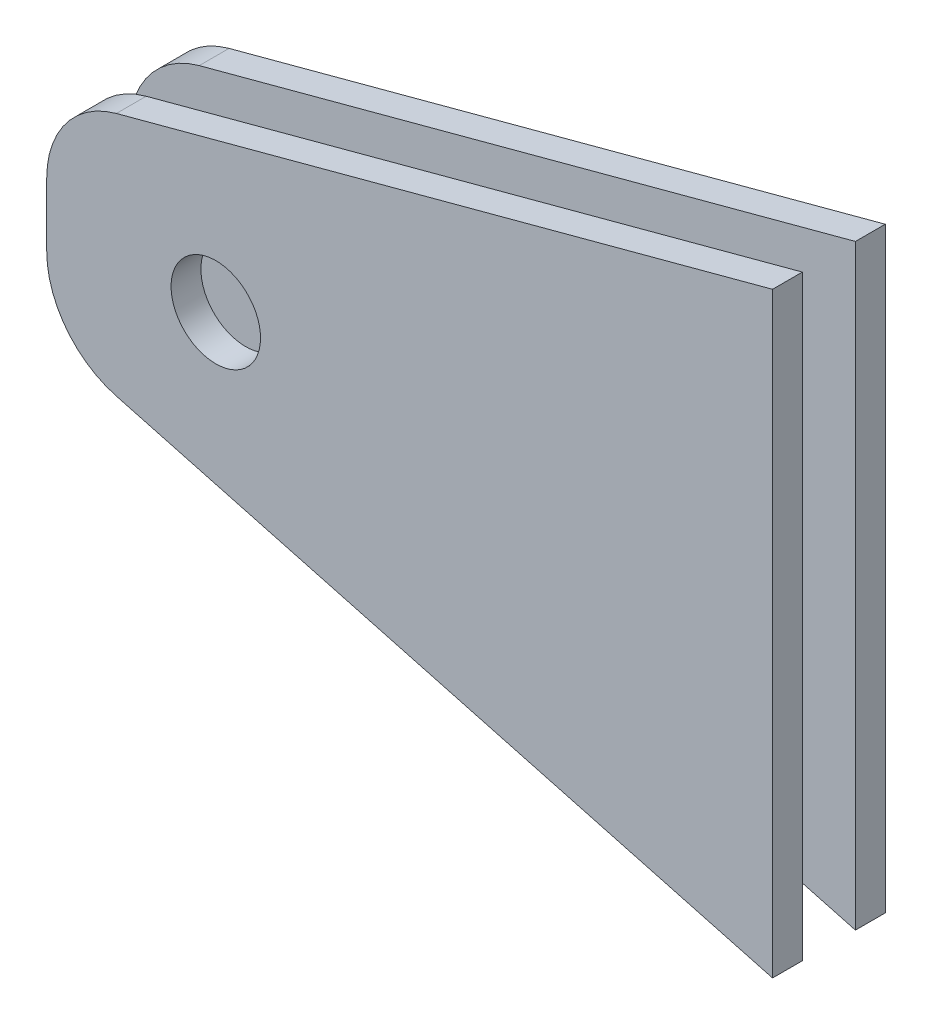
ISO-10303-21;
HEADER;
FILE_DESCRIPTION(('STEP AP214'),'2;1');
FILE_NAME('part.step','',(''),(''),'','','');
FILE_SCHEMA(('AUTOMOTIVE_DESIGN { 1 0 10303 214 1 1 1 1 }'));
ENDSEC;
DATA;
#1=APPLICATION_CONTEXT('core data for automotive mechanical design processes');
#2=APPLICATION_PROTOCOL_DEFINITION('international standard','automotive_design',2000,#1);
#3=PRODUCT_CONTEXT('',#1,'mechanical');
#4=PRODUCT('Part','Part','',(#3));
#5=PRODUCT_RELATED_PRODUCT_CATEGORY('part','',(#4));
#6=PRODUCT_DEFINITION_FORMATION('','',#4);
#7=PRODUCT_DEFINITION_CONTEXT('part definition',#1,'design');
#8=PRODUCT_DEFINITION('design','',#6,#7);
#9=PRODUCT_DEFINITION_SHAPE('','',#8);
#10=(LENGTH_UNIT() NAMED_UNIT(*) SI_UNIT(.MILLI.,.METRE.));
#11=(NAMED_UNIT(*) PLANE_ANGLE_UNIT() SI_UNIT($,.RADIAN.));
#12=(NAMED_UNIT(*) SI_UNIT($,.STERADIAN.) SOLID_ANGLE_UNIT());
#13=UNCERTAINTY_MEASURE_WITH_UNIT(LENGTH_MEASURE(1.E-05),#10,'distance_accuracy_value','');
#14=(GEOMETRIC_REPRESENTATION_CONTEXT(3) GLOBAL_UNCERTAINTY_ASSIGNED_CONTEXT((#13)) GLOBAL_UNIT_ASSIGNED_CONTEXT((#10,
#11,#12)) REPRESENTATION_CONTEXT('',''));
#15=CARTESIAN_POINT('',(0.,0.,0.));
#16=DIRECTION('',(0.,0.,1.));
#17=DIRECTION('',(1.,0.,0.));
#18=AXIS2_PLACEMENT_3D('',#15,#16,#17);
#19=CARTESIAN_POINT('',(0.,0.,12.));
#20=DIRECTION('',(0.258819045102518,0.965925826289069,0.));
#21=DIRECTION('',(-0.965925826289069,0.258819045102518,0.));
#22=AXIS2_PLACEMENT_3D('',#19,#20,#21);
#23=PLANE('',#22);
#24=DIRECTION('',(0.,0.,-1.));
#25=VECTOR('',#24,1.);
#26=CARTESIAN_POINT('',(-69.8622565541506,18.7195352251003,12.));
#27=LINE('',#26,#25);
#28=CARTESIAN_POINT('',(-69.8622565541506,18.7195352251003,12.));
#29=VERTEX_POINT('',#28);
#30=CARTESIAN_POINT('',(-69.8622565541506,18.7195352251003,8.825));
#31=VERTEX_POINT('',#30);
#32=EDGE_CURVE('E123',#29,#31,#27,.T.);
#33=ORIENTED_EDGE('',*,*,#32,.T.);
#34=DIRECTION('',(0.965925826289069,-0.258819045102518,0.));
#35=VECTOR('',#34,1.);
#36=CARTESIAN_POINT('',(0.,0.,8.825));
#37=LINE('',#36,#35);
#38=CARTESIAN_POINT('',(0.,0.,8.825));
#39=VERTEX_POINT('',#38);
#40=EDGE_CURVE('E65',#31,#39,#37,.T.);
#41=ORIENTED_EDGE('',*,*,#40,.T.);
#42=DIRECTION('',(0.,0.,-1.));
#43=VECTOR('',#42,1.);
#44=CARTESIAN_POINT('',(0.,0.,12.));
#45=LINE('',#44,#43);
#46=CARTESIAN_POINT('',(0.,0.,12.));
#47=VERTEX_POINT('',#46);
#48=EDGE_CURVE('E116',#47,#39,#45,.T.);
#49=ORIENTED_EDGE('',*,*,#48,.F.);
#50=DIRECTION('',(0.965925826289069,-0.258819045102518,0.));
#51=VECTOR('',#50,1.);
#52=CARTESIAN_POINT('',(0.,0.,12.));
#53=LINE('',#52,#51);
#54=EDGE_CURVE('E102',#29,#47,#53,.T.);
#55=ORIENTED_EDGE('',*,*,#54,.F.);
#56=EDGE_LOOP('',(#33,#41,#49,#55));
#57=FACE_BOUND('',#56,.T.);
#58=ADVANCED_FACE('F47',(#57),#23,.F.);
#59=CARTESIAN_POINT('',(0.,0.,12.));
#60=DIRECTION('',(-1.,0.,0.));
#61=DIRECTION('',(0.,0.,1.));
#62=AXIS2_PLACEMENT_3D('',#59,#60,#61);
#63=PLANE('',#62);
#64=ORIENTED_EDGE('',*,*,#48,.T.);
#65=DIRECTION('',(0.,1.,0.));
#66=VECTOR('',#65,1.);
#67=CARTESIAN_POINT('',(0.,0.,8.825));
#68=LINE('',#67,#66);
#69=CARTESIAN_POINT('',(0.,63.5,8.825));
#70=VERTEX_POINT('',#69);
#71=EDGE_CURVE('E121',#39,#70,#68,.T.);
#72=ORIENTED_EDGE('',*,*,#71,.T.);
#73=DIRECTION('',(0.,0.,-1.));
#74=VECTOR('',#73,1.);
#75=CARTESIAN_POINT('',(0.,63.5,12.));
#76=LINE('',#75,#74);
#77=CARTESIAN_POINT('',(0.,63.5,12.));
#78=VERTEX_POINT('',#77);
#79=EDGE_CURVE('E50',#78,#70,#76,.T.);
#80=ORIENTED_EDGE('',*,*,#79,.F.);
#81=DIRECTION('',(0.,1.,0.));
#82=VECTOR('',#81,1.);
#83=CARTESIAN_POINT('',(0.,0.,12.));
#84=LINE('',#83,#82);
#85=EDGE_CURVE('E99',#47,#78,#84,.T.);
#86=ORIENTED_EDGE('',*,*,#85,.F.);
#87=EDGE_LOOP('',(#64,#72,#80,#86));
#88=FACE_BOUND('',#87,.T.);
#89=ADVANCED_FACE('F114',(#88),#63,.F.);
#90=CARTESIAN_POINT('',(0.,63.5,12.));
#91=DIRECTION('',(0.258819045102525,-0.965925826289067,0.));
#92=DIRECTION('',(0.965925826289067,0.258819045102525,0.));
#93=AXIS2_PLACEMENT_3D('',#90,#91,#92);
#94=PLANE('',#93);
#95=ORIENTED_EDGE('',*,*,#79,.T.);
#96=DIRECTION('',(-0.965925826289067,-0.258819045102525,0.));
#97=VECTOR('',#96,1.);
#98=CARTESIAN_POINT('',(0.,63.5,8.825));
#99=LINE('',#98,#97);
#100=CARTESIAN_POINT('',(-69.8622565541506,44.7804647748991,8.825));
#101=VERTEX_POINT('',#100);
#102=EDGE_CURVE('E135',#70,#101,#99,.T.);
#103=ORIENTED_EDGE('',*,*,#102,.T.);
#104=DIRECTION('',(0.,0.,-1.));
#105=VECTOR('',#104,1.);
#106=CARTESIAN_POINT('',(-69.8622565541506,44.7804647748991,12.));
#107=LINE('',#106,#105);
#108=CARTESIAN_POINT('',(-69.8622565541506,44.7804647748991,12.));
#109=VERTEX_POINT('',#108);
#110=EDGE_CURVE('E131',#101,#109,#107,.F.);
#111=ORIENTED_EDGE('',*,*,#110,.T.);
#112=DIRECTION('',(-0.965925826289067,-0.258819045102525,0.));
#113=VECTOR('',#112,1.);
#114=CARTESIAN_POINT('',(0.,63.5,12.));
#115=LINE('',#114,#113);
#116=EDGE_CURVE('E119',#78,#109,#115,.T.);
#117=ORIENTED_EDGE('',*,*,#116,.F.);
#118=EDGE_LOOP('',(#95,#103,#111,#117));
#119=FACE_BOUND('',#118,.T.);
#120=ADVANCED_FACE('F160',(#119),#94,.F.);
#121=CARTESIAN_POINT('',(-77.2740661031254,42.794476391798,12.));
#122=DIRECTION('',(1.,0.,0.));
#123=DIRECTION('',(0.,0.,-1.));
#124=AXIS2_PLACEMENT_3D('',#121,#122,#123);
#125=PLANE('',#124);
#126=DIRECTION('',(0.,0.,-1.));
#127=VECTOR('',#126,1.);
#128=CARTESIAN_POINT('',(-77.2740661031254,35.1212065120084,12.));
#129=LINE('',#128,#127);
#130=CARTESIAN_POINT('',(-77.2740661031254,35.1212065120084,12.));
#131=VERTEX_POINT('',#130);
#132=CARTESIAN_POINT('',(-77.2740661031254,35.1212065120084,8.825));
#133=VERTEX_POINT('',#132);
#134=EDGE_CURVE('E127',#131,#133,#129,.T.);
#135=ORIENTED_EDGE('',*,*,#134,.T.);
#136=DIRECTION('',(0.,1.,0.));
#137=VECTOR('',#136,1.);
#138=CARTESIAN_POINT('',(-77.2740661031254,-14.9495122872016,8.825));
#139=LINE('',#138,#137);
#140=CARTESIAN_POINT('',(-77.2740661031254,28.378793487991,8.825));
#141=VERTEX_POINT('',#140);
#142=EDGE_CURVE('E56',#141,#133,#139,.T.);
#143=ORIENTED_EDGE('',*,*,#142,.F.);
#144=DIRECTION('',(0.,0.,-1.));
#145=VECTOR('',#144,1.);
#146=CARTESIAN_POINT('',(-77.2740661031254,28.378793487991,12.));
#147=LINE('',#146,#145);
#148=CARTESIAN_POINT('',(-77.2740661031254,28.378793487991,12.));
#149=VERTEX_POINT('',#148);
#150=EDGE_CURVE('E130',#141,#149,#147,.F.);
#151=ORIENTED_EDGE('',*,*,#150,.T.);
#152=DIRECTION('',(0.,-1.,0.));
#153=VECTOR('',#152,1.);
#154=CARTESIAN_POINT('',(-77.2740661031254,42.794476391798,12.));
#155=LINE('',#154,#153);
#156=EDGE_CURVE('E145',#131,#149,#155,.T.);
#157=ORIENTED_EDGE('',*,*,#156,.F.);
#158=EDGE_LOOP('',(#135,#143,#151,#157));
#159=FACE_BOUND('',#158,.T.);
#160=ADVANCED_FACE('F156',(#159),#125,.F.);
#161=CARTESIAN_POINT('',(-59.2740661031254,31.7499999999997,-13.4703841816037));
#162=DIRECTION('',(0.,0.,1.));
#163=DIRECTION('',(1.,0.,0.));
#164=AXIS2_PLACEMENT_3D('',#161,#162,#163);
#165=CYLINDRICAL_SURFACE('',#164,4.7625);
#166=CARTESIAN_POINT('',(-59.2740661031254,31.7499999999997,8.825));
#167=DIRECTION('',(0.,0.,1.));
#168=DIRECTION('',(1.,0.,0.));
#169=AXIS2_PLACEMENT_3D('',#166,#167,#168);
#170=CIRCLE('',#169,4.7625);
#171=CARTESIAN_POINT('',(-54.5115661031254,31.7499999999997,8.825));
#172=VERTEX_POINT('',#171);
#173=EDGE_CURVE('E133',#172,#172,#170,.F.);
#174=ORIENTED_EDGE('',*,*,#173,.T.);
#175=EDGE_LOOP('',(#174));
#176=FACE_BOUND('',#175,.T.);
#177=CARTESIAN_POINT('',(-59.2740661031254,31.7499999999997,12.));
#178=DIRECTION('',(0.,0.,1.));
#179=DIRECTION('',(1.,0.,0.));
#180=AXIS2_PLACEMENT_3D('',#177,#178,#179);
#181=CIRCLE('',#180,4.7625);
#182=CARTESIAN_POINT('',(-54.5115661031254,31.7499999999997,12.));
#183=VERTEX_POINT('',#182);
#184=EDGE_CURVE('E143',#183,#183,#181,.T.);
#185=ORIENTED_EDGE('',*,*,#184,.T.);
#186=EDGE_LOOP('',(#185));
#187=FACE_BOUND('',#186,.T.);
#188=ADVANCED_FACE('F167',(#176,#187),#165,.F.);
#189=CARTESIAN_POINT('',(-67.2740661031254,28.378793487991,12.));
#190=DIRECTION('',(0.,0.,-1.));
#191=DIRECTION('',(-1.,0.,0.));
#192=AXIS2_PLACEMENT_3D('',#189,#190,#191);
#193=CYLINDRICAL_SURFACE('',#192,10.);
#194=CARTESIAN_POINT('',(-67.2740661031254,28.378793487991,8.825));
#195=DIRECTION('',(0.,0.,1.));
#196=DIRECTION('',(1.,0.,0.));
#197=AXIS2_PLACEMENT_3D('',#194,#195,#196);
#198=CIRCLE('',#197,10.);
#199=EDGE_CURVE('E137',#31,#141,#198,.F.);
#200=ORIENTED_EDGE('',*,*,#199,.F.);
#201=ORIENTED_EDGE('',*,*,#32,.F.);
#202=CARTESIAN_POINT('',(-67.2740661031254,28.378793487991,12.));
#203=DIRECTION('',(0.,0.,1.));
#204=DIRECTION('',(1.,0.,0.));
#205=AXIS2_PLACEMENT_3D('',#202,#203,#204);
#206=CIRCLE('',#205,10.);
#207=EDGE_CURVE('E106',#149,#29,#206,.T.);
#208=ORIENTED_EDGE('',*,*,#207,.F.);
#209=ORIENTED_EDGE('',*,*,#150,.F.);
#210=EDGE_LOOP('',(#200,#201,#208,#209));
#211=FACE_BOUND('',#210,.T.);
#212=ADVANCED_FACE('F170',(#211),#193,.T.);
#213=CARTESIAN_POINT('',(-67.2740661031254,35.1212065120084,12.));
#214=DIRECTION('',(0.,0.,-1.));
#215=DIRECTION('',(-1.,0.,0.));
#216=AXIS2_PLACEMENT_3D('',#213,#214,#215);
#217=CYLINDRICAL_SURFACE('',#216,10.);
#218=CARTESIAN_POINT('',(-67.2740661031254,35.1212065120084,8.825));
#219=DIRECTION('',(0.,0.,1.));
#220=DIRECTION('',(1.,0.,0.));
#221=AXIS2_PLACEMENT_3D('',#218,#219,#220);
#222=CIRCLE('',#221,10.);
#223=EDGE_CURVE('E12',#133,#101,#222,.F.);
#224=ORIENTED_EDGE('',*,*,#223,.F.);
#225=ORIENTED_EDGE('',*,*,#134,.F.);
#226=CARTESIAN_POINT('',(-67.2740661031254,35.1212065120084,12.));
#227=DIRECTION('',(0.,0.,1.));
#228=DIRECTION('',(1.,0.,0.));
#229=AXIS2_PLACEMENT_3D('',#226,#227,#228);
#230=CIRCLE('',#229,10.);
#231=EDGE_CURVE('E140',#109,#131,#230,.T.);
#232=ORIENTED_EDGE('',*,*,#231,.F.);
#233=ORIENTED_EDGE('',*,*,#110,.F.);
#234=EDGE_LOOP('',(#224,#225,#232,#233));
#235=FACE_BOUND('',#234,.T.);
#236=ADVANCED_FACE('F158',(#235),#217,.T.);
#237=CARTESIAN_POINT('',(0.,0.,12.));
#238=DIRECTION('',(0.,0.,1.));
#239=DIRECTION('',(1.,0.,0.));
#240=AXIS2_PLACEMENT_3D('',#237,#238,#239);
#241=PLANE('',#240);
#242=ORIENTED_EDGE('',*,*,#184,.F.);
#243=EDGE_LOOP('',(#242));
#244=FACE_BOUND('',#243,.T.);
#245=ORIENTED_EDGE('',*,*,#156,.T.);
#246=ORIENTED_EDGE('',*,*,#207,.T.);
#247=ORIENTED_EDGE('',*,*,#54,.T.);
#248=ORIENTED_EDGE('',*,*,#85,.T.);
#249=ORIENTED_EDGE('',*,*,#116,.T.);
#250=ORIENTED_EDGE('',*,*,#231,.T.);
#251=EDGE_LOOP('',(#245,#246,#247,#248,#249,#250));
#252=FACE_BOUND('',#251,.T.);
#253=ADVANCED_FACE('F104',(#244,#252),#241,.T.);
#254=CARTESIAN_POINT('',(22.7259338968746,-14.9495122872016,8.825));
#255=DIRECTION('',(0.,0.,1.));
#256=DIRECTION('',(1.,0.,0.));
#257=AXIS2_PLACEMENT_3D('',#254,#255,#256);
#258=PLANE('',#257);
#259=ORIENTED_EDGE('',*,*,#199,.T.);
#260=ORIENTED_EDGE('',*,*,#142,.T.);
#261=ORIENTED_EDGE('',*,*,#223,.T.);
#262=ORIENTED_EDGE('',*,*,#102,.F.);
#263=ORIENTED_EDGE('',*,*,#71,.F.);
#264=ORIENTED_EDGE('',*,*,#40,.F.);
#265=EDGE_LOOP('',(#259,#260,#261,#262,#263,#264));
#266=FACE_BOUND('',#265,.T.);
#267=ORIENTED_EDGE('',*,*,#173,.F.);
#268=EDGE_LOOP('',(#267));
#269=FACE_BOUND('',#268,.T.);
#270=ADVANCED_FACE('F161',(#266,#269),#258,.F.);
#271=CLOSED_SHELL('',(#58,#89,#120,#160,#188,#212,#236,#253,#270));
#272=MANIFOLD_SOLID_BREP('B2',#271);
#273=CARTESIAN_POINT('',(-59.2740661031254,31.7499999999997,-13.4703841816037));
#274=DIRECTION('',(0.,0.,1.));
#275=DIRECTION('',(1.,0.,0.));
#276=AXIS2_PLACEMENT_3D('',#273,#274,#275);
#277=CYLINDRICAL_SURFACE('',#276,4.7625);
#278=CARTESIAN_POINT('',(-59.2740661031254,31.7499999999997,3.175));
#279=DIRECTION('',(0.,0.,-1.));
#280=DIRECTION('',(-1.,0.,0.));
#281=AXIS2_PLACEMENT_3D('',#278,#279,#280);
#282=CIRCLE('',#281,4.7625);
#283=CARTESIAN_POINT('',(-64.0365661031254,31.7499999999997,3.175));
#284=VERTEX_POINT('',#283);
#285=EDGE_CURVE('E350',#284,#284,#282,.F.);
#286=ORIENTED_EDGE('',*,*,#285,.T.);
#287=EDGE_LOOP('',(#286));
#288=FACE_BOUND('',#287,.T.);
#289=CARTESIAN_POINT('',(-59.2740661031254,31.7499999999997,0.));
#290=DIRECTION('',(0.,0.,1.));
#291=DIRECTION('',(1.,0.,0.));
#292=AXIS2_PLACEMENT_3D('',#289,#290,#291);
#293=CIRCLE('',#292,4.7625);
#294=CARTESIAN_POINT('',(-54.5115661031254,31.7499999999997,0.));
#295=VERTEX_POINT('',#294);
#296=EDGE_CURVE('E348',#295,#295,#293,.F.);
#297=ORIENTED_EDGE('',*,*,#296,.T.);
#298=EDGE_LOOP('',(#297));
#299=FACE_BOUND('',#298,.T.);
#300=ADVANCED_FACE('F244',(#288,#299),#277,.F.);
#301=CARTESIAN_POINT('',(0.,0.,0.));
#302=DIRECTION('',(0.,0.,1.));
#303=DIRECTION('',(1.,0.,0.));
#304=AXIS2_PLACEMENT_3D('',#301,#302,#303);
#305=PLANE('',#304);
#306=ORIENTED_EDGE('',*,*,#296,.F.);
#307=EDGE_LOOP('',(#306));
#308=FACE_BOUND('',#307,.T.);
#309=DIRECTION('',(0.965925826289069,-0.258819045102518,0.));
#310=VECTOR('',#309,1.);
#311=CARTESIAN_POINT('',(0.,0.,0.));
#312=LINE('',#311,#310);
#313=CARTESIAN_POINT('',(-69.8622565541506,18.7195352251003,0.));
#314=VERTEX_POINT('',#313);
#315=CARTESIAN_POINT('',(0.,0.,0.));
#316=VERTEX_POINT('',#315);
#317=EDGE_CURVE('E328',#314,#316,#312,.T.);
#318=ORIENTED_EDGE('',*,*,#317,.F.);
#319=CARTESIAN_POINT('',(-67.2740661031254,28.378793487991,0.));
#320=DIRECTION('',(0.,0.,1.));
#321=DIRECTION('',(1.,0.,0.));
#322=AXIS2_PLACEMENT_3D('',#319,#320,#321);
#323=CIRCLE('',#322,10.);
#324=CARTESIAN_POINT('',(-77.2740661031254,28.378793487991,0.));
#325=VERTEX_POINT('',#324);
#326=EDGE_CURVE('E312',#314,#325,#323,.F.);
#327=ORIENTED_EDGE('',*,*,#326,.T.);
#328=DIRECTION('',(0.,-1.,0.));
#329=VECTOR('',#328,1.);
#330=CARTESIAN_POINT('',(-77.2740661031254,42.794476391798,0.));
#331=LINE('',#330,#329);
#332=CARTESIAN_POINT('',(-77.2740661031254,35.1212065120084,0.));
#333=VERTEX_POINT('',#332);
#334=EDGE_CURVE('E324',#333,#325,#331,.T.);
#335=ORIENTED_EDGE('',*,*,#334,.F.);
#336=CARTESIAN_POINT('',(-67.2740661031254,35.1212065120084,0.));
#337=DIRECTION('',(0.,0.,1.));
#338=DIRECTION('',(1.,0.,0.));
#339=AXIS2_PLACEMENT_3D('',#336,#337,#338);
#340=CIRCLE('',#339,10.);
#341=CARTESIAN_POINT('',(-69.8622565541506,44.7804647748991,0.));
#342=VERTEX_POINT('',#341);
#343=EDGE_CURVE('E266',#333,#342,#340,.F.);
#344=ORIENTED_EDGE('',*,*,#343,.T.);
#345=DIRECTION('',(-0.965925826289067,-0.258819045102525,0.));
#346=VECTOR('',#345,1.);
#347=CARTESIAN_POINT('',(0.,63.5,0.));
#348=LINE('',#347,#346);
#349=CARTESIAN_POINT('',(0.,63.5,0.));
#350=VERTEX_POINT('',#349);
#351=EDGE_CURVE('E320',#350,#342,#348,.T.);
#352=ORIENTED_EDGE('',*,*,#351,.F.);
#353=DIRECTION('',(0.,1.,0.));
#354=VECTOR('',#353,1.);
#355=CARTESIAN_POINT('',(0.,0.,0.));
#356=LINE('',#355,#354);
#357=EDGE_CURVE('E325',#316,#350,#356,.T.);
#358=ORIENTED_EDGE('',*,*,#357,.F.);
#359=EDGE_LOOP('',(#318,#327,#335,#344,#352,#358));
#360=FACE_BOUND('',#359,.T.);
#361=ADVANCED_FACE('F347',(#308,#360),#305,.F.);
#362=CARTESIAN_POINT('',(-67.2740661031254,35.1212065120084,12.));
#363=DIRECTION('',(0.,0.,-1.));
#364=DIRECTION('',(-1.,0.,0.));
#365=AXIS2_PLACEMENT_3D('',#362,#363,#364);
#366=CYLINDRICAL_SURFACE('',#365,10.);
#367=CARTESIAN_POINT('',(-67.2740661031254,35.1212065120084,3.175));
#368=DIRECTION('',(0.,0.,-1.));
#369=DIRECTION('',(-1.,0.,0.));
#370=AXIS2_PLACEMENT_3D('',#367,#368,#369);
#371=CIRCLE('',#370,10.);
#372=CARTESIAN_POINT('',(-69.8622565541506,44.7804647748991,3.175));
#373=VERTEX_POINT('',#372);
#374=CARTESIAN_POINT('',(-77.2740661031254,35.1212065120084,3.175));
#375=VERTEX_POINT('',#374);
#376=EDGE_CURVE('E45',#373,#375,#371,.F.);
#377=ORIENTED_EDGE('',*,*,#376,.F.);
#378=DIRECTION('',(0.,0.,-1.));
#379=VECTOR('',#378,1.);
#380=CARTESIAN_POINT('',(-69.8622565541506,44.7804647748991,12.));
#381=LINE('',#380,#379);
#382=EDGE_CURVE('E252',#342,#373,#381,.F.);
#383=ORIENTED_EDGE('',*,*,#382,.F.);
#384=ORIENTED_EDGE('',*,*,#343,.F.);
#385=DIRECTION('',(0.,0.,-1.));
#386=VECTOR('',#385,1.);
#387=CARTESIAN_POINT('',(-77.2740661031254,35.1212065120084,12.));
#388=LINE('',#387,#386);
#389=EDGE_CURVE('E308',#375,#333,#388,.T.);
#390=ORIENTED_EDGE('',*,*,#389,.F.);
#391=EDGE_LOOP('',(#377,#383,#384,#390));
#392=FACE_BOUND('',#391,.T.);
#393=ADVANCED_FACE('F246',(#392),#366,.T.);
#394=CARTESIAN_POINT('',(-67.2740661031254,28.378793487991,12.));
#395=DIRECTION('',(0.,0.,-1.));
#396=DIRECTION('',(-1.,0.,0.));
#397=AXIS2_PLACEMENT_3D('',#394,#395,#396);
#398=CYLINDRICAL_SURFACE('',#397,10.);
#399=CARTESIAN_POINT('',(-67.2740661031254,28.378793487991,3.175));
#400=DIRECTION('',(0.,0.,-1.));
#401=DIRECTION('',(-1.,0.,0.));
#402=AXIS2_PLACEMENT_3D('',#399,#400,#401);
#403=CIRCLE('',#402,10.);
#404=CARTESIAN_POINT('',(-77.2740661031254,28.378793487991,3.175));
#405=VERTEX_POINT('',#404);
#406=CARTESIAN_POINT('',(-69.8622565541506,18.7195352251003,3.175));
#407=VERTEX_POINT('',#406);
#408=EDGE_CURVE('E355',#405,#407,#403,.F.);
#409=ORIENTED_EDGE('',*,*,#408,.F.);
#410=DIRECTION('',(0.,0.,-1.));
#411=VECTOR('',#410,1.);
#412=CARTESIAN_POINT('',(-77.2740661031254,28.378793487991,12.));
#413=LINE('',#412,#411);
#414=EDGE_CURVE('E310',#325,#405,#413,.F.);
#415=ORIENTED_EDGE('',*,*,#414,.F.);
#416=ORIENTED_EDGE('',*,*,#326,.F.);
#417=DIRECTION('',(0.,0.,-1.));
#418=VECTOR('',#417,1.);
#419=CARTESIAN_POINT('',(-69.8622565541506,18.7195352251003,12.));
#420=LINE('',#419,#418);
#421=EDGE_CURVE('E335',#407,#314,#420,.T.);
#422=ORIENTED_EDGE('',*,*,#421,.F.);
#423=EDGE_LOOP('',(#409,#415,#416,#422));
#424=FACE_BOUND('',#423,.T.);
#425=ADVANCED_FACE('F346',(#424),#398,.T.);
#426=CARTESIAN_POINT('',(-77.2740661031254,42.794476391798,12.));
#427=DIRECTION('',(1.,0.,0.));
#428=DIRECTION('',(0.,0.,-1.));
#429=AXIS2_PLACEMENT_3D('',#426,#427,#428);
#430=PLANE('',#429);
#431=ORIENTED_EDGE('',*,*,#414,.T.);
#432=DIRECTION('',(0.,-1.,0.));
#433=VECTOR('',#432,1.);
#434=CARTESIAN_POINT('',(-77.2740661031254,-14.9495122872016,3.175));
#435=LINE('',#434,#433);
#436=EDGE_CURVE('E298',#375,#405,#435,.T.);
#437=ORIENTED_EDGE('',*,*,#436,.F.);
#438=ORIENTED_EDGE('',*,*,#389,.T.);
#439=ORIENTED_EDGE('',*,*,#334,.T.);
#440=EDGE_LOOP('',(#431,#437,#438,#439));
#441=FACE_BOUND('',#440,.T.);
#442=ADVANCED_FACE('F306',(#441),#430,.F.);
#443=CARTESIAN_POINT('',(0.,63.5,12.));
#444=DIRECTION('',(0.258819045102525,-0.965925826289067,0.));
#445=DIRECTION('',(0.965925826289067,0.258819045102525,0.));
#446=AXIS2_PLACEMENT_3D('',#443,#444,#445);
#447=PLANE('',#446);
#448=ORIENTED_EDGE('',*,*,#382,.T.);
#449=DIRECTION('',(0.965925826289067,0.258819045102525,0.));
#450=VECTOR('',#449,1.);
#451=CARTESIAN_POINT('',(0.,63.5,3.175));
#452=LINE('',#451,#450);
#453=CARTESIAN_POINT('',(0.,63.5,3.175));
#454=VERTEX_POINT('',#453);
#455=EDGE_CURVE('E258',#373,#454,#452,.T.);
#456=ORIENTED_EDGE('',*,*,#455,.T.);
#457=DIRECTION('',(0.,0.,-1.));
#458=VECTOR('',#457,1.);
#459=CARTESIAN_POINT('',(0.,63.5,12.));
#460=LINE('',#459,#458);
#461=EDGE_CURVE('E321',#454,#350,#460,.T.);
#462=ORIENTED_EDGE('',*,*,#461,.T.);
#463=ORIENTED_EDGE('',*,*,#351,.T.);
#464=EDGE_LOOP('',(#448,#456,#462,#463));
#465=FACE_BOUND('',#464,.T.);
#466=ADVANCED_FACE('F318',(#465),#447,.F.);
#467=CARTESIAN_POINT('',(0.,0.,12.));
#468=DIRECTION('',(-1.,0.,0.));
#469=DIRECTION('',(0.,0.,1.));
#470=AXIS2_PLACEMENT_3D('',#467,#468,#469);
#471=PLANE('',#470);
#472=ORIENTED_EDGE('',*,*,#461,.F.);
#473=DIRECTION('',(0.,-1.,0.));
#474=VECTOR('',#473,1.);
#475=CARTESIAN_POINT('',(0.,0.,3.175));
#476=LINE('',#475,#474);
#477=CARTESIAN_POINT('',(0.,0.,3.175));
#478=VERTEX_POINT('',#477);
#479=EDGE_CURVE('E358',#454,#478,#476,.T.);
#480=ORIENTED_EDGE('',*,*,#479,.T.);
#481=DIRECTION('',(0.,0.,-1.));
#482=VECTOR('',#481,1.);
#483=CARTESIAN_POINT('',(0.,0.,12.));
#484=LINE('',#483,#482);
#485=EDGE_CURVE('E333',#478,#316,#484,.T.);
#486=ORIENTED_EDGE('',*,*,#485,.T.);
#487=ORIENTED_EDGE('',*,*,#357,.T.);
#488=EDGE_LOOP('',(#472,#480,#486,#487));
#489=FACE_BOUND('',#488,.T.);
#490=ADVANCED_FACE('F362',(#489),#471,.F.);
#491=CARTESIAN_POINT('',(0.,0.,12.));
#492=DIRECTION('',(0.258819045102518,0.965925826289069,0.));
#493=DIRECTION('',(-0.965925826289069,0.258819045102518,0.));
#494=AXIS2_PLACEMENT_3D('',#491,#492,#493);
#495=PLANE('',#494);
#496=ORIENTED_EDGE('',*,*,#485,.F.);
#497=DIRECTION('',(-0.965925826289069,0.258819045102518,0.));
#498=VECTOR('',#497,1.);
#499=CARTESIAN_POINT('',(0.,0.,3.175));
#500=LINE('',#499,#498);
#501=EDGE_CURVE('E344',#478,#407,#500,.T.);
#502=ORIENTED_EDGE('',*,*,#501,.T.);
#503=ORIENTED_EDGE('',*,*,#421,.T.);
#504=ORIENTED_EDGE('',*,*,#317,.T.);
#505=EDGE_LOOP('',(#496,#502,#503,#504));
#506=FACE_BOUND('',#505,.T.);
#507=ADVANCED_FACE('F342',(#506),#495,.F.);
#508=CARTESIAN_POINT('',(22.7259338968746,-14.9495122872016,3.175));
#509=DIRECTION('',(0.,0.,-1.));
#510=DIRECTION('',(-1.,0.,0.));
#511=AXIS2_PLACEMENT_3D('',#508,#509,#510);
#512=PLANE('',#511);
#513=ORIENTED_EDGE('',*,*,#408,.T.);
#514=ORIENTED_EDGE('',*,*,#501,.F.);
#515=ORIENTED_EDGE('',*,*,#479,.F.);
#516=ORIENTED_EDGE('',*,*,#455,.F.);
#517=ORIENTED_EDGE('',*,*,#376,.T.);
#518=ORIENTED_EDGE('',*,*,#436,.T.);
#519=EDGE_LOOP('',(#513,#514,#515,#516,#517,#518));
#520=FACE_BOUND('',#519,.T.);
#521=ORIENTED_EDGE('',*,*,#285,.F.);
#522=EDGE_LOOP('',(#521));
#523=FACE_BOUND('',#522,.T.);
#524=ADVANCED_FACE('F296',(#520,#523),#512,.F.);
#525=CLOSED_SHELL('',(#300,#361,#393,#425,#442,#466,#490,#507,#524));
#526=MANIFOLD_SOLID_BREP('B6',#525);
#527=ADVANCED_BREP_SHAPE_REPRESENTATION('',(#18,#272,#526),#14);
#528=SHAPE_DEFINITION_REPRESENTATION(#9,#527);
ENDSEC;
END-ISO-10303-21;
